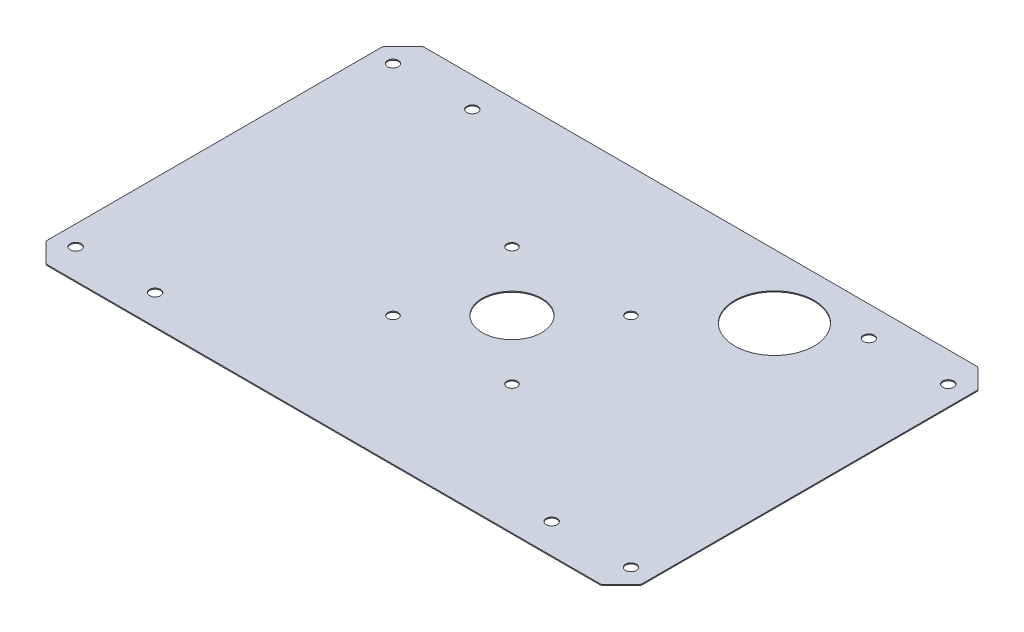
ISO-10303-21;
HEADER;
FILE_DESCRIPTION(('STEP AP214'),'2;1');
FILE_NAME('part.step','',(''),(''),'','','');
FILE_SCHEMA(('AUTOMOTIVE_DESIGN { 1 0 10303 214 1 1 1 1 }'));
ENDSEC;
DATA;
#1=APPLICATION_CONTEXT('core data for automotive mechanical design processes');
#2=APPLICATION_PROTOCOL_DEFINITION('international standard','automotive_design',2000,#1);
#3=PRODUCT_CONTEXT('',#1,'mechanical');
#4=PRODUCT('Part','Part','',(#3));
#5=PRODUCT_RELATED_PRODUCT_CATEGORY('part','',(#4));
#6=PRODUCT_DEFINITION_FORMATION('','',#4);
#7=PRODUCT_DEFINITION_CONTEXT('part definition',#1,'design');
#8=PRODUCT_DEFINITION('design','',#6,#7);
#9=PRODUCT_DEFINITION_SHAPE('','',#8);
#10=(LENGTH_UNIT() NAMED_UNIT(*) SI_UNIT(.MILLI.,.METRE.));
#11=(NAMED_UNIT(*) PLANE_ANGLE_UNIT() SI_UNIT($,.RADIAN.));
#12=(NAMED_UNIT(*) SI_UNIT($,.STERADIAN.) SOLID_ANGLE_UNIT());
#13=UNCERTAINTY_MEASURE_WITH_UNIT(LENGTH_MEASURE(1.E-05),#10,'distance_accuracy_value','');
#14=(GEOMETRIC_REPRESENTATION_CONTEXT(3) GLOBAL_UNCERTAINTY_ASSIGNED_CONTEXT((#13)) GLOBAL_UNIT_ASSIGNED_CONTEXT((#10,
#11,#12)) REPRESENTATION_CONTEXT('',''));
#15=CARTESIAN_POINT('',(0.,0.,0.));
#16=DIRECTION('',(0.,0.,1.));
#17=DIRECTION('',(1.,0.,0.));
#18=AXIS2_PLACEMENT_3D('',#15,#16,#17);
#19=CARTESIAN_POINT('',(140.,0.5,-80.));
#20=DIRECTION('',(0.,-1.,0.));
#21=DIRECTION('',(0.,0.,-1.));
#22=AXIS2_PLACEMENT_3D('',#19,#20,#21);
#23=CYLINDRICAL_SURFACE('',#22,2.75000000000001);
#24=CARTESIAN_POINT('',(140.,0.5,-80.));
#25=DIRECTION('',(0.,-1.,0.));
#26=DIRECTION('',(0.,0.,-1.));
#27=AXIS2_PLACEMENT_3D('',#24,#25,#26);
#28=CIRCLE('',#27,2.75000000000001);
#29=CARTESIAN_POINT('',(140.,0.5,-82.75));
#30=VERTEX_POINT('',#29);
#31=EDGE_CURVE('E49',#30,#30,#28,.T.);
#32=ORIENTED_EDGE('',*,*,#31,.F.);
#33=EDGE_LOOP('',(#32));
#34=FACE_BOUND('',#33,.T.);
#35=CARTESIAN_POINT('',(140.,0.,-80.));
#36=DIRECTION('',(0.,-1.,0.));
#37=DIRECTION('',(0.,0.,-1.));
#38=AXIS2_PLACEMENT_3D('',#35,#36,#37);
#39=CIRCLE('',#38,2.75000000000001);
#40=CARTESIAN_POINT('',(140.,0.,-82.75));
#41=VERTEX_POINT('',#40);
#42=EDGE_CURVE('E11',#41,#41,#39,.T.);
#43=ORIENTED_EDGE('',*,*,#42,.T.);
#44=EDGE_LOOP('',(#43));
#45=FACE_BOUND('',#44,.T.);
#46=ADVANCED_FACE('F41',(#34,#45),#23,.F.);
#47=CARTESIAN_POINT('',(-100.,0.5,-80.));
#48=DIRECTION('',(0.,-1.,0.));
#49=DIRECTION('',(0.,0.,-1.));
#50=AXIS2_PLACEMENT_3D('',#47,#48,#49);
#51=CYLINDRICAL_SURFACE('',#50,2.75000000000001);
#52=CARTESIAN_POINT('',(-100.,0.5,-80.));
#53=DIRECTION('',(0.,-1.,0.));
#54=DIRECTION('',(0.,0.,-1.));
#55=AXIS2_PLACEMENT_3D('',#52,#53,#54);
#56=CIRCLE('',#55,2.75000000000001);
#57=CARTESIAN_POINT('',(-100.,0.5,-82.75));
#58=VERTEX_POINT('',#57);
#59=EDGE_CURVE('E290',#58,#58,#56,.T.);
#60=ORIENTED_EDGE('',*,*,#59,.F.);
#61=EDGE_LOOP('',(#60));
#62=FACE_BOUND('',#61,.T.);
#63=CARTESIAN_POINT('',(-100.,0.,-80.));
#64=DIRECTION('',(0.,-1.,0.));
#65=DIRECTION('',(0.,0.,-1.));
#66=AXIS2_PLACEMENT_3D('',#63,#64,#65);
#67=CIRCLE('',#66,2.75000000000001);
#68=CARTESIAN_POINT('',(-100.,0.,-82.75));
#69=VERTEX_POINT('',#68);
#70=EDGE_CURVE('E293',#69,#69,#67,.T.);
#71=ORIENTED_EDGE('',*,*,#70,.T.);
#72=EDGE_LOOP('',(#71));
#73=FACE_BOUND('',#72,.T.);
#74=ADVANCED_FACE('F385',(#62,#73),#51,.F.);
#75=CARTESIAN_POINT('',(99.9999999999999,0.5,-80.));
#76=DIRECTION('',(0.,-1.,0.));
#77=DIRECTION('',(0.,0.,-1.));
#78=AXIS2_PLACEMENT_3D('',#75,#76,#77);
#79=CYLINDRICAL_SURFACE('',#78,2.75000000000001);
#80=CARTESIAN_POINT('',(99.9999999999999,0.5,-80.));
#81=DIRECTION('',(0.,-1.,0.));
#82=DIRECTION('',(0.,0.,-1.));
#83=AXIS2_PLACEMENT_3D('',#80,#81,#82);
#84=CIRCLE('',#83,2.75000000000001);
#85=CARTESIAN_POINT('',(99.9999999999999,0.5,-82.75));
#86=VERTEX_POINT('',#85);
#87=EDGE_CURVE('E284',#86,#86,#84,.T.);
#88=ORIENTED_EDGE('',*,*,#87,.F.);
#89=EDGE_LOOP('',(#88));
#90=FACE_BOUND('',#89,.T.);
#91=CARTESIAN_POINT('',(99.9999999999999,0.,-80.));
#92=DIRECTION('',(0.,-1.,0.));
#93=DIRECTION('',(0.,0.,-1.));
#94=AXIS2_PLACEMENT_3D('',#91,#92,#93);
#95=CIRCLE('',#94,2.75000000000001);
#96=CARTESIAN_POINT('',(99.9999999999999,0.,-82.75));
#97=VERTEX_POINT('',#96);
#98=EDGE_CURVE('E287',#97,#97,#95,.T.);
#99=ORIENTED_EDGE('',*,*,#98,.T.);
#100=EDGE_LOOP('',(#99));
#101=FACE_BOUND('',#100,.T.);
#102=ADVANCED_FACE('F390',(#90,#101),#79,.F.);
#103=CARTESIAN_POINT('',(-140.,0.5,-80.));
#104=DIRECTION('',(0.,-1.,0.));
#105=DIRECTION('',(0.,0.,-1.));
#106=AXIS2_PLACEMENT_3D('',#103,#104,#105);
#107=CYLINDRICAL_SURFACE('',#106,2.75000000000001);
#108=CARTESIAN_POINT('',(-140.,0.5,-80.));
#109=DIRECTION('',(0.,-1.,0.));
#110=DIRECTION('',(0.,0.,-1.));
#111=AXIS2_PLACEMENT_3D('',#108,#109,#110);
#112=CIRCLE('',#111,2.75000000000001);
#113=CARTESIAN_POINT('',(-140.,0.5,-82.75));
#114=VERTEX_POINT('',#113);
#115=EDGE_CURVE('E278',#114,#114,#112,.T.);
#116=ORIENTED_EDGE('',*,*,#115,.F.);
#117=EDGE_LOOP('',(#116));
#118=FACE_BOUND('',#117,.T.);
#119=CARTESIAN_POINT('',(-140.,0.,-80.));
#120=DIRECTION('',(0.,-1.,0.));
#121=DIRECTION('',(0.,0.,-1.));
#122=AXIS2_PLACEMENT_3D('',#119,#120,#121);
#123=CIRCLE('',#122,2.75000000000001);
#124=CARTESIAN_POINT('',(-140.,0.,-82.75));
#125=VERTEX_POINT('',#124);
#126=EDGE_CURVE('E281',#125,#125,#123,.T.);
#127=ORIENTED_EDGE('',*,*,#126,.T.);
#128=EDGE_LOOP('',(#127));
#129=FACE_BOUND('',#128,.T.);
#130=ADVANCED_FACE('F421',(#118,#129),#107,.F.);
#131=CARTESIAN_POINT('',(150.,0.5,95.));
#132=DIRECTION('',(-1.,0.,0.));
#133=DIRECTION('',(0.,0.,1.));
#134=AXIS2_PLACEMENT_3D('',#131,#132,#133);
#135=PLANE('',#134);
#136=DIRECTION('',(0.,0.,-1.));
#137=VECTOR('',#136,1.);
#138=CARTESIAN_POINT('',(150.,0.,95.));
#139=LINE('',#138,#137);
#140=CARTESIAN_POINT('',(150.,0.,84.1715728752538));
#141=VERTEX_POINT('',#140);
#142=CARTESIAN_POINT('',(150.,0.,-84.1715728752538));
#143=VERTEX_POINT('',#142);
#144=EDGE_CURVE('E194',#141,#143,#139,.T.);
#145=ORIENTED_EDGE('',*,*,#144,.T.);
#146=DIRECTION('',(0.,-1.,0.));
#147=VECTOR('',#146,1.);
#148=CARTESIAN_POINT('',(150.,0.5,-84.1715728752538));
#149=LINE('',#148,#147);
#150=CARTESIAN_POINT('',(150.,0.5,-84.1715728752538));
#151=VERTEX_POINT('',#150);
#152=EDGE_CURVE('E261',#143,#151,#149,.F.);
#153=ORIENTED_EDGE('',*,*,#152,.T.);
#154=DIRECTION('',(0.,0.,-1.));
#155=VECTOR('',#154,1.);
#156=CARTESIAN_POINT('',(150.,0.5,95.));
#157=LINE('',#156,#155);
#158=CARTESIAN_POINT('',(150.,0.5,84.1715728752538));
#159=VERTEX_POINT('',#158);
#160=EDGE_CURVE('E191',#159,#151,#157,.T.);
#161=ORIENTED_EDGE('',*,*,#160,.F.);
#162=DIRECTION('',(0.,1.,0.));
#163=VECTOR('',#162,1.);
#164=CARTESIAN_POINT('',(150.,0.,84.1715728752538));
#165=LINE('',#164,#163);
#166=EDGE_CURVE('E258',#159,#141,#165,.F.);
#167=ORIENTED_EDGE('',*,*,#166,.T.);
#168=EDGE_LOOP('',(#145,#153,#161,#167));
#169=FACE_BOUND('',#168,.T.);
#170=ADVANCED_FACE('F349',(#169),#135,.F.);
#171=CARTESIAN_POINT('',(-150.,0.5,-95.));
#172=DIRECTION('',(0.,0.,1.));
#173=DIRECTION('',(1.,0.,0.));
#174=AXIS2_PLACEMENT_3D('',#171,#172,#173);
#175=PLANE('',#174);
#176=DIRECTION('',(-1.,0.,0.));
#177=VECTOR('',#176,1.);
#178=CARTESIAN_POINT('',(-150.,0.,-95.));
#179=LINE('',#178,#177);
#180=CARTESIAN_POINT('',(139.171572875254,0.,-95.));
#181=VERTEX_POINT('',#180);
#182=CARTESIAN_POINT('',(-139.171572875254,0.,-95.));
#183=VERTEX_POINT('',#182);
#184=EDGE_CURVE('E188',#181,#183,#179,.T.);
#185=ORIENTED_EDGE('',*,*,#184,.T.);
#186=DIRECTION('',(0.,-1.,0.));
#187=VECTOR('',#186,1.);
#188=CARTESIAN_POINT('',(-139.171572875254,0.5,-95.));
#189=LINE('',#188,#187);
#190=CARTESIAN_POINT('',(-139.171572875254,0.5,-95.));
#191=VERTEX_POINT('',#190);
#192=EDGE_CURVE('E252',#183,#191,#189,.F.);
#193=ORIENTED_EDGE('',*,*,#192,.T.);
#194=DIRECTION('',(-1.,0.,0.));
#195=VECTOR('',#194,1.);
#196=CARTESIAN_POINT('',(-150.,0.5,-95.));
#197=LINE('',#196,#195);
#198=CARTESIAN_POINT('',(139.171572875254,0.5,-95.));
#199=VERTEX_POINT('',#198);
#200=EDGE_CURVE('E341',#199,#191,#197,.T.);
#201=ORIENTED_EDGE('',*,*,#200,.F.);
#202=DIRECTION('',(0.,1.,0.));
#203=VECTOR('',#202,1.);
#204=CARTESIAN_POINT('',(139.171572875254,0.,-95.));
#205=LINE('',#204,#203);
#206=EDGE_CURVE('E249',#199,#181,#205,.F.);
#207=ORIENTED_EDGE('',*,*,#206,.T.);
#208=EDGE_LOOP('',(#185,#193,#201,#207));
#209=FACE_BOUND('',#208,.T.);
#210=ADVANCED_FACE('F368',(#209),#175,.F.);
#211=CARTESIAN_POINT('',(-150.,0.5,95.));
#212=DIRECTION('',(1.,0.,0.));
#213=DIRECTION('',(0.,0.,-1.));
#214=AXIS2_PLACEMENT_3D('',#211,#212,#213);
#215=PLANE('',#214);
#216=DIRECTION('',(0.,0.,1.));
#217=VECTOR('',#216,1.);
#218=CARTESIAN_POINT('',(-150.,0.5,95.));
#219=LINE('',#218,#217);
#220=CARTESIAN_POINT('',(-150.,0.5,-84.1715728752538));
#221=VERTEX_POINT('',#220);
#222=CARTESIAN_POINT('',(-150.,0.5,84.1715728752538));
#223=VERTEX_POINT('',#222);
#224=EDGE_CURVE('E179',#221,#223,#219,.T.);
#225=ORIENTED_EDGE('',*,*,#224,.F.);
#226=DIRECTION('',(0.,1.,0.));
#227=VECTOR('',#226,1.);
#228=CARTESIAN_POINT('',(-150.,0.,-84.1715728752538));
#229=LINE('',#228,#227);
#230=CARTESIAN_POINT('',(-150.,0.,-84.1715728752538));
#231=VERTEX_POINT('',#230);
#232=EDGE_CURVE('E162',#221,#231,#229,.F.);
#233=ORIENTED_EDGE('',*,*,#232,.T.);
#234=DIRECTION('',(0.,0.,1.));
#235=VECTOR('',#234,1.);
#236=CARTESIAN_POINT('',(-150.,0.,95.));
#237=LINE('',#236,#235);
#238=CARTESIAN_POINT('',(-150.,0.,84.1715728752538));
#239=VERTEX_POINT('',#238);
#240=EDGE_CURVE('E176',#231,#239,#237,.T.);
#241=ORIENTED_EDGE('',*,*,#240,.T.);
#242=DIRECTION('',(0.,-1.,0.));
#243=VECTOR('',#242,1.);
#244=CARTESIAN_POINT('',(-150.,0.5,84.1715728752538));
#245=LINE('',#244,#243);
#246=EDGE_CURVE('E181',#239,#223,#245,.F.);
#247=ORIENTED_EDGE('',*,*,#246,.T.);
#248=EDGE_LOOP('',(#225,#233,#241,#247));
#249=FACE_BOUND('',#248,.T.);
#250=ADVANCED_FACE('F174',(#249),#215,.F.);
#251=CARTESIAN_POINT('',(-150.,0.5,95.));
#252=DIRECTION('',(0.,0.,-1.));
#253=DIRECTION('',(-1.,0.,0.));
#254=AXIS2_PLACEMENT_3D('',#251,#252,#253);
#255=PLANE('',#254);
#256=DIRECTION('',(1.,0.,0.));
#257=VECTOR('',#256,1.);
#258=CARTESIAN_POINT('',(-150.,0.,95.));
#259=LINE('',#258,#257);
#260=CARTESIAN_POINT('',(-139.171572875254,0.,95.));
#261=VERTEX_POINT('',#260);
#262=CARTESIAN_POINT('',(139.171572875254,0.,95.));
#263=VERTEX_POINT('',#262);
#264=EDGE_CURVE('E187',#261,#263,#259,.T.);
#265=ORIENTED_EDGE('',*,*,#264,.T.);
#266=DIRECTION('',(0.,-1.,0.));
#267=VECTOR('',#266,1.);
#268=CARTESIAN_POINT('',(139.171572875254,0.5,95.));
#269=LINE('',#268,#267);
#270=CARTESIAN_POINT('',(139.171572875254,0.5,95.));
#271=VERTEX_POINT('',#270);
#272=EDGE_CURVE('E271',#263,#271,#269,.F.);
#273=ORIENTED_EDGE('',*,*,#272,.T.);
#274=DIRECTION('',(1.,0.,0.));
#275=VECTOR('',#274,1.);
#276=CARTESIAN_POINT('',(-150.,0.5,95.));
#277=LINE('',#276,#275);
#278=CARTESIAN_POINT('',(-139.171572875254,0.5,95.));
#279=VERTEX_POINT('',#278);
#280=EDGE_CURVE('E201',#279,#271,#277,.T.);
#281=ORIENTED_EDGE('',*,*,#280,.F.);
#282=DIRECTION('',(0.,1.,0.));
#283=VECTOR('',#282,1.);
#284=CARTESIAN_POINT('',(-139.171572875254,0.,95.));
#285=LINE('',#284,#283);
#286=EDGE_CURVE('E268',#279,#261,#285,.F.);
#287=ORIENTED_EDGE('',*,*,#286,.T.);
#288=EDGE_LOOP('',(#265,#273,#281,#287));
#289=FACE_BOUND('',#288,.T.);
#290=ADVANCED_FACE('F406',(#289),#255,.F.);
#291=CARTESIAN_POINT('',(0.,0.5,0.));
#292=DIRECTION('',(0.,-1.,0.));
#293=DIRECTION('',(0.,0.,-1.));
#294=AXIS2_PLACEMENT_3D('',#291,#292,#293);
#295=PLANE('',#294);
#296=CARTESIAN_POINT('',(-30.,0.5,30.));
#297=DIRECTION('',(0.,1.,0.));
#298=DIRECTION('',(0.,0.,1.));
#299=AXIS2_PLACEMENT_3D('',#296,#297,#298);
#300=CIRCLE('',#299,2.6);
#301=CARTESIAN_POINT('',(-30.,0.5,32.6));
#302=VERTEX_POINT('',#301);
#303=EDGE_CURVE('E810',#302,#302,#300,.T.);
#304=ORIENTED_EDGE('',*,*,#303,.F.);
#305=EDGE_LOOP('',(#304));
#306=FACE_BOUND('',#305,.T.);
#307=CARTESIAN_POINT('',(30.,0.5,30.));
#308=DIRECTION('',(0.,1.,0.));
#309=DIRECTION('',(0.,0.,1.));
#310=AXIS2_PLACEMENT_3D('',#307,#308,#309);
#311=CIRCLE('',#310,2.6);
#312=CARTESIAN_POINT('',(30.,0.5,32.6));
#313=VERTEX_POINT('',#312);
#314=EDGE_CURVE('E814',#313,#313,#311,.T.);
#315=ORIENTED_EDGE('',*,*,#314,.F.);
#316=EDGE_LOOP('',(#315));
#317=FACE_BOUND('',#316,.T.);
#318=CARTESIAN_POINT('',(30.,0.5,-30.));
#319=DIRECTION('',(0.,1.,0.));
#320=DIRECTION('',(0.,0.,1.));
#321=AXIS2_PLACEMENT_3D('',#318,#319,#320);
#322=CIRCLE('',#321,2.6);
#323=CARTESIAN_POINT('',(30.,0.5,-27.4));
#324=VERTEX_POINT('',#323);
#325=EDGE_CURVE('E822',#324,#324,#322,.T.);
#326=ORIENTED_EDGE('',*,*,#325,.F.);
#327=EDGE_LOOP('',(#326));
#328=FACE_BOUND('',#327,.T.);
#329=CARTESIAN_POINT('',(-30.,0.5,-30.));
#330=DIRECTION('',(0.,1.,0.));
#331=DIRECTION('',(0.,0.,1.));
#332=AXIS2_PLACEMENT_3D('',#329,#330,#331);
#333=CIRCLE('',#332,2.6);
#334=CARTESIAN_POINT('',(-30.,0.5,-27.4));
#335=VERTEX_POINT('',#334);
#336=EDGE_CURVE('E313',#335,#335,#333,.T.);
#337=ORIENTED_EDGE('',*,*,#336,.F.);
#338=EDGE_LOOP('',(#337));
#339=FACE_BOUND('',#338,.T.);
#340=CARTESIAN_POINT('',(69.5499999999999,0.5,-62.8));
#341=DIRECTION('',(0.,1.,0.));
#342=DIRECTION('',(0.,0.,1.));
#343=AXIS2_PLACEMENT_3D('',#340,#341,#342);
#344=CIRCLE('',#343,20.);
#345=CARTESIAN_POINT('',(69.5499999999999,0.5,-42.8));
#346=VERTEX_POINT('',#345);
#347=EDGE_CURVE('E299',#346,#346,#344,.T.);
#348=ORIENTED_EDGE('',*,*,#347,.F.);
#349=EDGE_LOOP('',(#348));
#350=FACE_BOUND('',#349,.T.);
#351=CARTESIAN_POINT('',(0.,0.5,0.));
#352=DIRECTION('',(0.,1.,0.));
#353=DIRECTION('',(0.,0.,1.));
#354=AXIS2_PLACEMENT_3D('',#351,#352,#353);
#355=CIRCLE('',#354,15.);
#356=CARTESIAN_POINT('',(0.,0.5,15.));
#357=VERTEX_POINT('',#356);
#358=EDGE_CURVE('E305',#357,#357,#355,.T.);
#359=ORIENTED_EDGE('',*,*,#358,.F.);
#360=EDGE_LOOP('',(#359));
#361=FACE_BOUND('',#360,.T.);
#362=CARTESIAN_POINT('',(140.,0.5,80.));
#363=DIRECTION('',(0.,-1.,0.));
#364=DIRECTION('',(0.,0.,-1.));
#365=AXIS2_PLACEMENT_3D('',#362,#363,#364);
#366=CIRCLE('',#365,2.75000000000001);
#367=CARTESIAN_POINT('',(140.,0.5,77.25));
#368=VERTEX_POINT('',#367);
#369=EDGE_CURVE('E303',#368,#368,#366,.T.);
#370=ORIENTED_EDGE('',*,*,#369,.T.);
#371=EDGE_LOOP('',(#370));
#372=FACE_BOUND('',#371,.T.);
#373=CARTESIAN_POINT('',(99.9999999999999,0.5,80.));
#374=DIRECTION('',(0.,-1.,0.));
#375=DIRECTION('',(0.,0.,-1.));
#376=AXIS2_PLACEMENT_3D('',#373,#374,#375);
#377=CIRCLE('',#376,2.75000000000001);
#378=CARTESIAN_POINT('',(99.9999999999999,0.5,77.25));
#379=VERTEX_POINT('',#378);
#380=EDGE_CURVE('E321',#379,#379,#377,.T.);
#381=ORIENTED_EDGE('',*,*,#380,.T.);
#382=EDGE_LOOP('',(#381));
#383=FACE_BOUND('',#382,.T.);
#384=CARTESIAN_POINT('',(-140.,0.5,80.));
#385=DIRECTION('',(0.,-1.,0.));
#386=DIRECTION('',(0.,0.,-1.));
#387=AXIS2_PLACEMENT_3D('',#384,#385,#386);
#388=CIRCLE('',#387,2.75000000000001);
#389=CARTESIAN_POINT('',(-140.,0.5,77.25));
#390=VERTEX_POINT('',#389);
#391=EDGE_CURVE('E328',#390,#390,#388,.T.);
#392=ORIENTED_EDGE('',*,*,#391,.T.);
#393=EDGE_LOOP('',(#392));
#394=FACE_BOUND('',#393,.T.);
#395=CARTESIAN_POINT('',(-100.,0.5,80.));
#396=DIRECTION('',(0.,-1.,0.));
#397=DIRECTION('',(0.,0.,-1.));
#398=AXIS2_PLACEMENT_3D('',#395,#396,#397);
#399=CIRCLE('',#398,2.75000000000001);
#400=CARTESIAN_POINT('',(-100.,0.5,77.25));
#401=VERTEX_POINT('',#400);
#402=EDGE_CURVE('E327',#401,#401,#399,.T.);
#403=ORIENTED_EDGE('',*,*,#402,.T.);
#404=EDGE_LOOP('',(#403));
#405=FACE_BOUND('',#404,.T.);
#406=DIRECTION('',(0.707106781186549,0.,-0.707106781186546));
#407=VECTOR('',#406,1.);
#408=CARTESIAN_POINT('',(-150.,0.5,-85.));
#409=LINE('',#408,#407);
#410=CARTESIAN_POINT('',(-140.585786437627,0.5,-94.4142135623731));
#411=VERTEX_POINT('',#410);
#412=CARTESIAN_POINT('',(-149.414213562373,0.5,-85.5857864376269));
#413=VERTEX_POINT('',#412);
#414=EDGE_CURVE('E209',#411,#413,#409,.F.);
#415=ORIENTED_EDGE('',*,*,#414,.T.);
#416=CARTESIAN_POINT('',(-148.,0.5,-84.1715728752538));
#417=DIRECTION('',(0.,-1.,0.));
#418=DIRECTION('',(0.,0.,-1.));
#419=AXIS2_PLACEMENT_3D('',#416,#417,#418);
#420=CIRCLE('',#419,2.);
#421=EDGE_CURVE('E247',#413,#221,#420,.F.);
#422=ORIENTED_EDGE('',*,*,#421,.T.);
#423=ORIENTED_EDGE('',*,*,#224,.T.);
#424=CARTESIAN_POINT('',(-148.,0.5,84.1715728752538));
#425=DIRECTION('',(0.,-1.,0.));
#426=DIRECTION('',(0.,0.,-1.));
#427=AXIS2_PLACEMENT_3D('',#424,#425,#426);
#428=CIRCLE('',#427,2.);
#429=CARTESIAN_POINT('',(-149.414213562373,0.5,85.5857864376269));
#430=VERTEX_POINT('',#429);
#431=EDGE_CURVE('E235',#223,#430,#428,.F.);
#432=ORIENTED_EDGE('',*,*,#431,.T.);
#433=DIRECTION('',(-0.707106781186548,0.,-0.707106781186548));
#434=VECTOR('',#433,1.);
#435=CARTESIAN_POINT('',(-140.,0.5,95.));
#436=LINE('',#435,#434);
#437=CARTESIAN_POINT('',(-140.585786437627,0.5,94.4142135623731));
#438=VERTEX_POINT('',#437);
#439=EDGE_CURVE('E217',#430,#438,#436,.F.);
#440=ORIENTED_EDGE('',*,*,#439,.T.);
#441=CARTESIAN_POINT('',(-139.171572875254,0.5,93.));
#442=DIRECTION('',(0.,-1.,0.));
#443=DIRECTION('',(0.,0.,-1.));
#444=AXIS2_PLACEMENT_3D('',#441,#442,#443);
#445=CIRCLE('',#444,2.);
#446=EDGE_CURVE('E237',#438,#279,#445,.F.);
#447=ORIENTED_EDGE('',*,*,#446,.T.);
#448=ORIENTED_EDGE('',*,*,#280,.T.);
#449=CARTESIAN_POINT('',(139.171572875254,0.5,93.));
#450=DIRECTION('',(0.,-1.,0.));
#451=DIRECTION('',(0.,0.,-1.));
#452=AXIS2_PLACEMENT_3D('',#449,#450,#451);
#453=CIRCLE('',#452,2.);
#454=CARTESIAN_POINT('',(140.585786437627,0.5,94.4142135623731));
#455=VERTEX_POINT('',#454);
#456=EDGE_CURVE('E239',#271,#455,#453,.F.);
#457=ORIENTED_EDGE('',*,*,#456,.T.);
#458=DIRECTION('',(-0.707106781186549,0.,0.707106781186546));
#459=VECTOR('',#458,1.);
#460=CARTESIAN_POINT('',(150.,0.5,85.));
#461=LINE('',#460,#459);
#462=CARTESIAN_POINT('',(149.414213562373,0.5,85.5857864376269));
#463=VERTEX_POINT('',#462);
#464=EDGE_CURVE('E214',#455,#463,#461,.F.);
#465=ORIENTED_EDGE('',*,*,#464,.T.);
#466=CARTESIAN_POINT('',(148.,0.5,84.1715728752538));
#467=DIRECTION('',(0.,-1.,0.));
#468=DIRECTION('',(0.,0.,-1.));
#469=AXIS2_PLACEMENT_3D('',#466,#467,#468);
#470=CIRCLE('',#469,2.);
#471=EDGE_CURVE('E241',#463,#159,#470,.F.);
#472=ORIENTED_EDGE('',*,*,#471,.T.);
#473=ORIENTED_EDGE('',*,*,#160,.T.);
#474=CARTESIAN_POINT('',(148.,0.5,-84.1715728752538));
#475=DIRECTION('',(0.,-1.,0.));
#476=DIRECTION('',(0.,0.,-1.));
#477=AXIS2_PLACEMENT_3D('',#474,#475,#476);
#478=CIRCLE('',#477,2.);
#479=CARTESIAN_POINT('',(149.414213562373,0.5,-85.5857864376269));
#480=VERTEX_POINT('',#479);
#481=EDGE_CURVE('E243',#151,#480,#478,.F.);
#482=ORIENTED_EDGE('',*,*,#481,.T.);
#483=DIRECTION('',(0.707106781186548,0.,0.707106781186548));
#484=VECTOR('',#483,1.);
#485=CARTESIAN_POINT('',(140.,0.5,-95.));
#486=LINE('',#485,#484);
#487=CARTESIAN_POINT('',(140.585786437627,0.5,-94.4142135623731));
#488=VERTEX_POINT('',#487);
#489=EDGE_CURVE('E212',#480,#488,#486,.F.);
#490=ORIENTED_EDGE('',*,*,#489,.T.);
#491=CARTESIAN_POINT('',(139.171572875254,0.5,-93.));
#492=DIRECTION('',(0.,-1.,0.));
#493=DIRECTION('',(0.,0.,-1.));
#494=AXIS2_PLACEMENT_3D('',#491,#492,#493);
#495=CIRCLE('',#494,2.);
#496=EDGE_CURVE('E65',#488,#199,#495,.F.);
#497=ORIENTED_EDGE('',*,*,#496,.T.);
#498=ORIENTED_EDGE('',*,*,#200,.T.);
#499=CARTESIAN_POINT('',(-139.171572875254,0.5,-93.));
#500=DIRECTION('',(0.,-1.,0.));
#501=DIRECTION('',(0.,0.,-1.));
#502=AXIS2_PLACEMENT_3D('',#499,#500,#501);
#503=CIRCLE('',#502,2.);
#504=EDGE_CURVE('E57',#191,#411,#503,.F.);
#505=ORIENTED_EDGE('',*,*,#504,.T.);
#506=EDGE_LOOP('',(#415,#422,#423,#432,#440,#447,#448,#457,#465,#472,#473,#482,#490,#497,#498,#505));
#507=FACE_BOUND('',#506,.T.);
#508=ORIENTED_EDGE('',*,*,#115,.T.);
#509=EDGE_LOOP('',(#508));
#510=FACE_BOUND('',#509,.T.);
#511=ORIENTED_EDGE('',*,*,#87,.T.);
#512=EDGE_LOOP('',(#511));
#513=FACE_BOUND('',#512,.T.);
#514=ORIENTED_EDGE('',*,*,#59,.T.);
#515=EDGE_LOOP('',(#514));
#516=FACE_BOUND('',#515,.T.);
#517=ORIENTED_EDGE('',*,*,#31,.T.);
#518=EDGE_LOOP('',(#517));
#519=FACE_BOUND('',#518,.T.);
#520=ADVANCED_FACE('F357',(#306,#317,#328,#339,#350,#361,#372,#383,#394,#405,#507,#510,#513,
#516,#519),#295,.F.);
#521=CARTESIAN_POINT('',(0.,0.,0.));
#522=DIRECTION('',(0.,-1.,0.));
#523=DIRECTION('',(0.,0.,-1.));
#524=AXIS2_PLACEMENT_3D('',#521,#522,#523);
#525=PLANE('',#524);
#526=CARTESIAN_POINT('',(-30.,0.,30.));
#527=DIRECTION('',(0.,1.,0.));
#528=DIRECTION('',(0.,0.,1.));
#529=AXIS2_PLACEMENT_3D('',#526,#527,#528);
#530=CIRCLE('',#529,2.6);
#531=CARTESIAN_POINT('',(-30.,0.,32.6));
#532=VERTEX_POINT('',#531);
#533=EDGE_CURVE('E807',#532,#532,#530,.T.);
#534=ORIENTED_EDGE('',*,*,#533,.T.);
#535=EDGE_LOOP('',(#534));
#536=FACE_BOUND('',#535,.T.);
#537=CARTESIAN_POINT('',(30.,0.,30.));
#538=DIRECTION('',(0.,1.,0.));
#539=DIRECTION('',(0.,0.,1.));
#540=AXIS2_PLACEMENT_3D('',#537,#538,#539);
#541=CIRCLE('',#540,2.6);
#542=CARTESIAN_POINT('',(30.,0.,32.6));
#543=VERTEX_POINT('',#542);
#544=EDGE_CURVE('E811',#543,#543,#541,.T.);
#545=ORIENTED_EDGE('',*,*,#544,.T.);
#546=EDGE_LOOP('',(#545));
#547=FACE_BOUND('',#546,.T.);
#548=CARTESIAN_POINT('',(30.,0.,-30.));
#549=DIRECTION('',(0.,1.,0.));
#550=DIRECTION('',(0.,0.,1.));
#551=AXIS2_PLACEMENT_3D('',#548,#549,#550);
#552=CIRCLE('',#551,2.6);
#553=CARTESIAN_POINT('',(30.,0.,-27.4));
#554=VERTEX_POINT('',#553);
#555=EDGE_CURVE('E826',#554,#554,#552,.T.);
#556=ORIENTED_EDGE('',*,*,#555,.T.);
#557=EDGE_LOOP('',(#556));
#558=FACE_BOUND('',#557,.T.);
#559=CARTESIAN_POINT('',(-30.,0.,-30.));
#560=DIRECTION('',(0.,1.,0.));
#561=DIRECTION('',(0.,0.,1.));
#562=AXIS2_PLACEMENT_3D('',#559,#560,#561);
#563=CIRCLE('',#562,2.6);
#564=CARTESIAN_POINT('',(-30.,0.,-27.4));
#565=VERTEX_POINT('',#564);
#566=EDGE_CURVE('E310',#565,#565,#563,.T.);
#567=ORIENTED_EDGE('',*,*,#566,.T.);
#568=EDGE_LOOP('',(#567));
#569=FACE_BOUND('',#568,.T.);
#570=CARTESIAN_POINT('',(69.5499999999999,0.,-62.8));
#571=DIRECTION('',(0.,-1.,0.));
#572=DIRECTION('',(0.,0.,-1.));
#573=AXIS2_PLACEMENT_3D('',#570,#571,#572);
#574=CIRCLE('',#573,20.);
#575=CARTESIAN_POINT('',(69.5499999999999,0.,-82.8));
#576=VERTEX_POINT('',#575);
#577=EDGE_CURVE('E44',#576,#576,#574,.T.);
#578=ORIENTED_EDGE('',*,*,#577,.F.);
#579=EDGE_LOOP('',(#578));
#580=FACE_BOUND('',#579,.T.);
#581=CARTESIAN_POINT('',(0.,0.,0.));
#582=DIRECTION('',(0.,-1.,0.));
#583=DIRECTION('',(0.,0.,-1.));
#584=AXIS2_PLACEMENT_3D('',#581,#582,#583);
#585=CIRCLE('',#584,15.);
#586=CARTESIAN_POINT('',(0.,0.,-15.));
#587=VERTEX_POINT('',#586);
#588=EDGE_CURVE('E297',#587,#587,#585,.T.);
#589=ORIENTED_EDGE('',*,*,#588,.F.);
#590=EDGE_LOOP('',(#589));
#591=FACE_BOUND('',#590,.T.);
#592=CARTESIAN_POINT('',(140.,0.,80.));
#593=DIRECTION('',(0.,-1.,0.));
#594=DIRECTION('',(0.,0.,-1.));
#595=AXIS2_PLACEMENT_3D('',#592,#593,#594);
#596=CIRCLE('',#595,2.75000000000001);
#597=CARTESIAN_POINT('',(140.,0.,77.25));
#598=VERTEX_POINT('',#597);
#599=EDGE_CURVE('E318',#598,#598,#596,.T.);
#600=ORIENTED_EDGE('',*,*,#599,.F.);
#601=EDGE_LOOP('',(#600));
#602=FACE_BOUND('',#601,.T.);
#603=CARTESIAN_POINT('',(99.9999999999999,0.,80.));
#604=DIRECTION('',(0.,-1.,0.));
#605=DIRECTION('',(0.,0.,-1.));
#606=AXIS2_PLACEMENT_3D('',#603,#604,#605);
#607=CIRCLE('',#606,2.75000000000001);
#608=CARTESIAN_POINT('',(99.9999999999999,0.,77.25));
#609=VERTEX_POINT('',#608);
#610=EDGE_CURVE('E324',#609,#609,#607,.T.);
#611=ORIENTED_EDGE('',*,*,#610,.F.);
#612=EDGE_LOOP('',(#611));
#613=FACE_BOUND('',#612,.T.);
#614=CARTESIAN_POINT('',(-140.,0.,80.));
#615=DIRECTION('',(0.,-1.,0.));
#616=DIRECTION('',(0.,0.,-1.));
#617=AXIS2_PLACEMENT_3D('',#614,#615,#616);
#618=CIRCLE('',#617,2.75000000000001);
#619=CARTESIAN_POINT('',(-140.,0.,77.25));
#620=VERTEX_POINT('',#619);
#621=EDGE_CURVE('E331',#620,#620,#618,.T.);
#622=ORIENTED_EDGE('',*,*,#621,.F.);
#623=EDGE_LOOP('',(#622));
#624=FACE_BOUND('',#623,.T.);
#625=CARTESIAN_POINT('',(-100.,0.,80.));
#626=DIRECTION('',(0.,-1.,0.));
#627=DIRECTION('',(0.,0.,-1.));
#628=AXIS2_PLACEMENT_3D('',#625,#626,#627);
#629=CIRCLE('',#628,2.75000000000001);
#630=CARTESIAN_POINT('',(-100.,0.,77.25));
#631=VERTEX_POINT('',#630);
#632=EDGE_CURVE('E334',#631,#631,#629,.T.);
#633=ORIENTED_EDGE('',*,*,#632,.F.);
#634=EDGE_LOOP('',(#633));
#635=FACE_BOUND('',#634,.T.);
#636=ORIENTED_EDGE('',*,*,#240,.F.);
#637=CARTESIAN_POINT('',(-148.,0.,-84.1715728752538));
#638=DIRECTION('',(0.,-1.,0.));
#639=DIRECTION('',(0.,0.,-1.));
#640=AXIS2_PLACEMENT_3D('',#637,#638,#639);
#641=CIRCLE('',#640,2.);
#642=CARTESIAN_POINT('',(-149.414213562373,0.,-85.585786437627));
#643=VERTEX_POINT('',#642);
#644=EDGE_CURVE('E158',#231,#643,#641,.T.);
#645=ORIENTED_EDGE('',*,*,#644,.T.);
#646=DIRECTION('',(-0.707106781186549,0.,0.707106781186546));
#647=VECTOR('',#646,1.);
#648=CARTESIAN_POINT('',(-117.5,0.,-117.5));
#649=LINE('',#648,#647);
#650=CARTESIAN_POINT('',(-140.585786437627,0.,-94.4142135623731));
#651=VERTEX_POINT('',#650);
#652=EDGE_CURVE('E198',#643,#651,#649,.F.);
#653=ORIENTED_EDGE('',*,*,#652,.T.);
#654=CARTESIAN_POINT('',(-139.171572875254,0.,-93.));
#655=DIRECTION('',(0.,-1.,0.));
#656=DIRECTION('',(0.,0.,-1.));
#657=AXIS2_PLACEMENT_3D('',#654,#655,#656);
#658=CIRCLE('',#657,2.);
#659=EDGE_CURVE('E169',#651,#183,#658,.T.);
#660=ORIENTED_EDGE('',*,*,#659,.T.);
#661=ORIENTED_EDGE('',*,*,#184,.F.);
#662=CARTESIAN_POINT('',(139.171572875254,0.,-93.));
#663=DIRECTION('',(0.,-1.,0.));
#664=DIRECTION('',(0.,0.,-1.));
#665=AXIS2_PLACEMENT_3D('',#662,#663,#664);
#666=CIRCLE('',#665,2.);
#667=CARTESIAN_POINT('',(140.585786437627,0.,-94.4142135623731));
#668=VERTEX_POINT('',#667);
#669=EDGE_CURVE('E230',#181,#668,#666,.T.);
#670=ORIENTED_EDGE('',*,*,#669,.T.);
#671=DIRECTION('',(-0.707106781186548,0.,-0.707106781186548));
#672=VECTOR('',#671,1.);
#673=CARTESIAN_POINT('',(117.5,0.,-117.5));
#674=LINE('',#673,#672);
#675=CARTESIAN_POINT('',(149.414213562373,0.,-85.5857864376269));
#676=VERTEX_POINT('',#675);
#677=EDGE_CURVE('E200',#668,#676,#674,.F.);
#678=ORIENTED_EDGE('',*,*,#677,.T.);
#679=CARTESIAN_POINT('',(148.,0.,-84.1715728752538));
#680=DIRECTION('',(0.,-1.,0.));
#681=DIRECTION('',(0.,0.,-1.));
#682=AXIS2_PLACEMENT_3D('',#679,#680,#681);
#683=CIRCLE('',#682,2.);
#684=EDGE_CURVE('E228',#676,#143,#683,.T.);
#685=ORIENTED_EDGE('',*,*,#684,.T.);
#686=ORIENTED_EDGE('',*,*,#144,.F.);
#687=CARTESIAN_POINT('',(148.,0.,84.1715728752538));
#688=DIRECTION('',(0.,-1.,0.));
#689=DIRECTION('',(0.,0.,-1.));
#690=AXIS2_PLACEMENT_3D('',#687,#688,#689);
#691=CIRCLE('',#690,2.);
#692=CARTESIAN_POINT('',(149.414213562373,0.,85.5857864376269));
#693=VERTEX_POINT('',#692);
#694=EDGE_CURVE('E226',#141,#693,#691,.T.);
#695=ORIENTED_EDGE('',*,*,#694,.T.);
#696=DIRECTION('',(0.707106781186549,0.,-0.707106781186546));
#697=VECTOR('',#696,1.);
#698=CARTESIAN_POINT('',(117.5,0.,117.5));
#699=LINE('',#698,#697);
#700=CARTESIAN_POINT('',(140.585786437627,0.,94.4142135623731));
#701=VERTEX_POINT('',#700);
#702=EDGE_CURVE('E204',#693,#701,#699,.F.);
#703=ORIENTED_EDGE('',*,*,#702,.T.);
#704=CARTESIAN_POINT('',(139.171572875254,0.,93.));
#705=DIRECTION('',(0.,-1.,0.));
#706=DIRECTION('',(0.,0.,-1.));
#707=AXIS2_PLACEMENT_3D('',#704,#705,#706);
#708=CIRCLE('',#707,2.);
#709=EDGE_CURVE('E224',#701,#263,#708,.T.);
#710=ORIENTED_EDGE('',*,*,#709,.T.);
#711=ORIENTED_EDGE('',*,*,#264,.F.);
#712=CARTESIAN_POINT('',(-139.171572875254,0.,93.));
#713=DIRECTION('',(0.,-1.,0.));
#714=DIRECTION('',(0.,0.,-1.));
#715=AXIS2_PLACEMENT_3D('',#712,#713,#714);
#716=CIRCLE('',#715,2.);
#717=CARTESIAN_POINT('',(-140.585786437627,0.,94.4142135623731));
#718=VERTEX_POINT('',#717);
#719=EDGE_CURVE('E222',#261,#718,#716,.T.);
#720=ORIENTED_EDGE('',*,*,#719,.T.);
#721=DIRECTION('',(0.707106781186548,0.,0.707106781186548));
#722=VECTOR('',#721,1.);
#723=CARTESIAN_POINT('',(-117.5,0.,117.5));
#724=LINE('',#723,#722);
#725=CARTESIAN_POINT('',(-149.414213562373,0.,85.5857864376269));
#726=VERTEX_POINT('',#725);
#727=EDGE_CURVE('E207',#718,#726,#724,.F.);
#728=ORIENTED_EDGE('',*,*,#727,.T.);
#729=CARTESIAN_POINT('',(-148.,0.,84.1715728752538));
#730=DIRECTION('',(0.,-1.,0.));
#731=DIRECTION('',(0.,0.,-1.));
#732=AXIS2_PLACEMENT_3D('',#729,#730,#731);
#733=CIRCLE('',#732,2.);
#734=EDGE_CURVE('E180',#726,#239,#733,.T.);
#735=ORIENTED_EDGE('',*,*,#734,.T.);
#736=EDGE_LOOP('',(#636,#645,#653,#660,#661,#670,#678,#685,#686,#695,#703,#710,#711,#720,#728,#735));
#737=FACE_BOUND('',#736,.T.);
#738=ORIENTED_EDGE('',*,*,#126,.F.);
#739=EDGE_LOOP('',(#738));
#740=FACE_BOUND('',#739,.T.);
#741=ORIENTED_EDGE('',*,*,#98,.F.);
#742=EDGE_LOOP('',(#741));
#743=FACE_BOUND('',#742,.T.);
#744=ORIENTED_EDGE('',*,*,#70,.F.);
#745=EDGE_LOOP('',(#744));
#746=FACE_BOUND('',#745,.T.);
#747=ORIENTED_EDGE('',*,*,#42,.F.);
#748=EDGE_LOOP('',(#747));
#749=FACE_BOUND('',#748,.T.);
#750=ADVANCED_FACE('F183',(#536,#547,#558,#569,#580,#591,#602,#613,#624,#635,#737,#740,#743,
#746,#749),#525,.T.);
#751=CARTESIAN_POINT('',(-140.,0.5,95.));
#752=DIRECTION('',(0.707106781186547,0.,-0.707106781186547));
#753=DIRECTION('',(0.,-1.,0.));
#754=AXIS2_PLACEMENT_3D('',#751,#752,#753);
#755=PLANE('',#754);
#756=ORIENTED_EDGE('',*,*,#727,.F.);
#757=DIRECTION('',(0.,-1.,0.));
#758=VECTOR('',#757,1.);
#759=CARTESIAN_POINT('',(-140.585786437627,0.5,94.4142135623731));
#760=LINE('',#759,#758);
#761=EDGE_CURVE('E276',#718,#438,#760,.F.);
#762=ORIENTED_EDGE('',*,*,#761,.T.);
#763=ORIENTED_EDGE('',*,*,#439,.F.);
#764=DIRECTION('',(0.,1.,0.));
#765=VECTOR('',#764,1.);
#766=CARTESIAN_POINT('',(-149.414213562373,0.,85.5857864376269));
#767=LINE('',#766,#765);
#768=EDGE_CURVE('E274',#430,#726,#767,.F.);
#769=ORIENTED_EDGE('',*,*,#768,.T.);
#770=EDGE_LOOP('',(#756,#762,#763,#769));
#771=FACE_BOUND('',#770,.T.);
#772=ADVANCED_FACE('F397',(#771),#755,.F.);
#773=CARTESIAN_POINT('',(150.,0.5,85.));
#774=DIRECTION('',(-0.707106781186545,0.,-0.707106781186549));
#775=DIRECTION('',(0.,-1.,0.));
#776=AXIS2_PLACEMENT_3D('',#773,#774,#775);
#777=PLANE('',#776);
#778=ORIENTED_EDGE('',*,*,#702,.F.);
#779=DIRECTION('',(0.,-1.,0.));
#780=VECTOR('',#779,1.);
#781=CARTESIAN_POINT('',(149.414213562373,0.5,85.5857864376269));
#782=LINE('',#781,#780);
#783=EDGE_CURVE('E266',#693,#463,#782,.F.);
#784=ORIENTED_EDGE('',*,*,#783,.T.);
#785=ORIENTED_EDGE('',*,*,#464,.F.);
#786=DIRECTION('',(0.,1.,0.));
#787=VECTOR('',#786,1.);
#788=CARTESIAN_POINT('',(140.585786437627,0.,94.4142135623731));
#789=LINE('',#788,#787);
#790=EDGE_CURVE('E264',#455,#701,#789,.F.);
#791=ORIENTED_EDGE('',*,*,#790,.T.);
#792=EDGE_LOOP('',(#778,#784,#785,#791));
#793=FACE_BOUND('',#792,.T.);
#794=ADVANCED_FACE('F381',(#793),#777,.F.);
#795=CARTESIAN_POINT('',(140.,0.5,-95.));
#796=DIRECTION('',(-0.707106781186547,0.,0.707106781186547));
#797=DIRECTION('',(0.,-1.,0.));
#798=AXIS2_PLACEMENT_3D('',#795,#796,#797);
#799=PLANE('',#798);
#800=ORIENTED_EDGE('',*,*,#677,.F.);
#801=DIRECTION('',(0.,-1.,0.));
#802=VECTOR('',#801,1.);
#803=CARTESIAN_POINT('',(140.585786437627,0.5,-94.4142135623731));
#804=LINE('',#803,#802);
#805=EDGE_CURVE('E256',#668,#488,#804,.F.);
#806=ORIENTED_EDGE('',*,*,#805,.T.);
#807=ORIENTED_EDGE('',*,*,#489,.F.);
#808=DIRECTION('',(0.,1.,0.));
#809=VECTOR('',#808,1.);
#810=CARTESIAN_POINT('',(149.414213562373,0.,-85.5857864376269));
#811=LINE('',#810,#809);
#812=EDGE_CURVE('E254',#480,#676,#811,.F.);
#813=ORIENTED_EDGE('',*,*,#812,.T.);
#814=EDGE_LOOP('',(#800,#806,#807,#813));
#815=FACE_BOUND('',#814,.T.);
#816=ADVANCED_FACE('F361',(#815),#799,.F.);
#817=CARTESIAN_POINT('',(-150.,0.5,-85.));
#818=DIRECTION('',(0.707106781186546,0.,0.707106781186549));
#819=DIRECTION('',(0.,-1.,0.));
#820=AXIS2_PLACEMENT_3D('',#817,#818,#819);
#821=PLANE('',#820);
#822=ORIENTED_EDGE('',*,*,#652,.F.);
#823=DIRECTION('',(0.,-1.,0.));
#824=VECTOR('',#823,1.);
#825=CARTESIAN_POINT('',(-149.414213562373,0.5,-85.5857864376269));
#826=LINE('',#825,#824);
#827=EDGE_CURVE('E163',#643,#413,#826,.F.);
#828=ORIENTED_EDGE('',*,*,#827,.T.);
#829=ORIENTED_EDGE('',*,*,#414,.F.);
#830=DIRECTION('',(0.,1.,0.));
#831=VECTOR('',#830,1.);
#832=CARTESIAN_POINT('',(-140.585786437627,0.,-94.4142135623731));
#833=LINE('',#832,#831);
#834=EDGE_CURVE('E168',#411,#651,#833,.F.);
#835=ORIENTED_EDGE('',*,*,#834,.T.);
#836=EDGE_LOOP('',(#822,#828,#829,#835));
#837=FACE_BOUND('',#836,.T.);
#838=ADVANCED_FACE('F373',(#837),#821,.F.);
#839=CARTESIAN_POINT('',(-148.,0.5,-84.1715728752538));
#840=DIRECTION('',(0.,-1.,0.));
#841=DIRECTION('',(0.,0.,-1.));
#842=AXIS2_PLACEMENT_3D('',#839,#840,#841);
#843=CYLINDRICAL_SURFACE('',#842,2.);
#844=ORIENTED_EDGE('',*,*,#421,.F.);
#845=ORIENTED_EDGE('',*,*,#827,.F.);
#846=ORIENTED_EDGE('',*,*,#644,.F.);
#847=ORIENTED_EDGE('',*,*,#232,.F.);
#848=EDGE_LOOP('',(#844,#845,#846,#847));
#849=FACE_BOUND('',#848,.T.);
#850=ADVANCED_FACE('F161',(#849),#843,.T.);
#851=CARTESIAN_POINT('',(-139.171572875254,0.5,-93.));
#852=DIRECTION('',(0.,1.,0.));
#853=DIRECTION('',(0.,0.,1.));
#854=AXIS2_PLACEMENT_3D('',#851,#852,#853);
#855=CYLINDRICAL_SURFACE('',#854,2.);
#856=ORIENTED_EDGE('',*,*,#659,.F.);
#857=ORIENTED_EDGE('',*,*,#834,.F.);
#858=ORIENTED_EDGE('',*,*,#504,.F.);
#859=ORIENTED_EDGE('',*,*,#192,.F.);
#860=EDGE_LOOP('',(#856,#857,#858,#859));
#861=FACE_BOUND('',#860,.T.);
#862=ADVANCED_FACE('F370',(#861),#855,.T.);
#863=CARTESIAN_POINT('',(139.171572875254,0.5,-93.));
#864=DIRECTION('',(0.,-1.,0.));
#865=DIRECTION('',(0.,0.,-1.));
#866=AXIS2_PLACEMENT_3D('',#863,#864,#865);
#867=CYLINDRICAL_SURFACE('',#866,2.);
#868=ORIENTED_EDGE('',*,*,#496,.F.);
#869=ORIENTED_EDGE('',*,*,#805,.F.);
#870=ORIENTED_EDGE('',*,*,#669,.F.);
#871=ORIENTED_EDGE('',*,*,#206,.F.);
#872=EDGE_LOOP('',(#868,#869,#870,#871));
#873=FACE_BOUND('',#872,.T.);
#874=ADVANCED_FACE('F364',(#873),#867,.T.);
#875=CARTESIAN_POINT('',(148.,0.5,-84.1715728752538));
#876=DIRECTION('',(0.,1.,0.));
#877=DIRECTION('',(0.,0.,1.));
#878=AXIS2_PLACEMENT_3D('',#875,#876,#877);
#879=CYLINDRICAL_SURFACE('',#878,2.);
#880=ORIENTED_EDGE('',*,*,#684,.F.);
#881=ORIENTED_EDGE('',*,*,#812,.F.);
#882=ORIENTED_EDGE('',*,*,#481,.F.);
#883=ORIENTED_EDGE('',*,*,#152,.F.);
#884=EDGE_LOOP('',(#880,#881,#882,#883));
#885=FACE_BOUND('',#884,.T.);
#886=ADVANCED_FACE('F354',(#885),#879,.T.);
#887=CARTESIAN_POINT('',(148.,0.5,84.1715728752538));
#888=DIRECTION('',(0.,-1.,0.));
#889=DIRECTION('',(0.,0.,-1.));
#890=AXIS2_PLACEMENT_3D('',#887,#888,#889);
#891=CYLINDRICAL_SURFACE('',#890,2.);
#892=ORIENTED_EDGE('',*,*,#471,.F.);
#893=ORIENTED_EDGE('',*,*,#783,.F.);
#894=ORIENTED_EDGE('',*,*,#694,.F.);
#895=ORIENTED_EDGE('',*,*,#166,.F.);
#896=EDGE_LOOP('',(#892,#893,#894,#895));
#897=FACE_BOUND('',#896,.T.);
#898=ADVANCED_FACE('F445',(#897),#891,.T.);
#899=CARTESIAN_POINT('',(139.171572875254,0.5,93.));
#900=DIRECTION('',(0.,1.,0.));
#901=DIRECTION('',(0.,0.,1.));
#902=AXIS2_PLACEMENT_3D('',#899,#900,#901);
#903=CYLINDRICAL_SURFACE('',#902,2.);
#904=ORIENTED_EDGE('',*,*,#709,.F.);
#905=ORIENTED_EDGE('',*,*,#790,.F.);
#906=ORIENTED_EDGE('',*,*,#456,.F.);
#907=ORIENTED_EDGE('',*,*,#272,.F.);
#908=EDGE_LOOP('',(#904,#905,#906,#907));
#909=FACE_BOUND('',#908,.T.);
#910=ADVANCED_FACE('F447',(#909),#903,.T.);
#911=CARTESIAN_POINT('',(-139.171572875254,0.5,93.));
#912=DIRECTION('',(0.,-1.,0.));
#913=DIRECTION('',(0.,0.,-1.));
#914=AXIS2_PLACEMENT_3D('',#911,#912,#913);
#915=CYLINDRICAL_SURFACE('',#914,2.);
#916=ORIENTED_EDGE('',*,*,#446,.F.);
#917=ORIENTED_EDGE('',*,*,#761,.F.);
#918=ORIENTED_EDGE('',*,*,#719,.F.);
#919=ORIENTED_EDGE('',*,*,#286,.F.);
#920=EDGE_LOOP('',(#916,#917,#918,#919));
#921=FACE_BOUND('',#920,.T.);
#922=ADVANCED_FACE('F454',(#921),#915,.T.);
#923=CARTESIAN_POINT('',(-148.,0.5,84.1715728752538));
#924=DIRECTION('',(0.,1.,0.));
#925=DIRECTION('',(0.,0.,1.));
#926=AXIS2_PLACEMENT_3D('',#923,#924,#925);
#927=CYLINDRICAL_SURFACE('',#926,2.);
#928=ORIENTED_EDGE('',*,*,#734,.F.);
#929=ORIENTED_EDGE('',*,*,#768,.F.);
#930=ORIENTED_EDGE('',*,*,#431,.F.);
#931=ORIENTED_EDGE('',*,*,#246,.F.);
#932=EDGE_LOOP('',(#928,#929,#930,#931));
#933=FACE_BOUND('',#932,.T.);
#934=ADVANCED_FACE('F460',(#933),#927,.T.);
#935=CARTESIAN_POINT('',(-100.,0.5,80.));
#936=DIRECTION('',(0.,-1.,0.));
#937=DIRECTION('',(0.,0.,-1.));
#938=AXIS2_PLACEMENT_3D('',#935,#936,#937);
#939=CYLINDRICAL_SURFACE('',#938,2.75000000000001);
#940=ORIENTED_EDGE('',*,*,#402,.F.);
#941=EDGE_LOOP('',(#940));
#942=FACE_BOUND('',#941,.T.);
#943=ORIENTED_EDGE('',*,*,#632,.T.);
#944=EDGE_LOOP('',(#943));
#945=FACE_BOUND('',#944,.T.);
#946=ADVANCED_FACE('F462',(#942,#945),#939,.F.);
#947=CARTESIAN_POINT('',(-140.,0.5,80.));
#948=DIRECTION('',(0.,-1.,0.));
#949=DIRECTION('',(0.,0.,-1.));
#950=AXIS2_PLACEMENT_3D('',#947,#948,#949);
#951=CYLINDRICAL_SURFACE('',#950,2.75000000000001);
#952=ORIENTED_EDGE('',*,*,#391,.F.);
#953=EDGE_LOOP('',(#952));
#954=FACE_BOUND('',#953,.T.);
#955=ORIENTED_EDGE('',*,*,#621,.T.);
#956=EDGE_LOOP('',(#955));
#957=FACE_BOUND('',#956,.T.);
#958=ADVANCED_FACE('F468',(#954,#957),#951,.F.);
#959=CARTESIAN_POINT('',(99.9999999999999,0.5,80.));
#960=DIRECTION('',(0.,-1.,0.));
#961=DIRECTION('',(0.,0.,-1.));
#962=AXIS2_PLACEMENT_3D('',#959,#960,#961);
#963=CYLINDRICAL_SURFACE('',#962,2.75000000000001);
#964=ORIENTED_EDGE('',*,*,#380,.F.);
#965=EDGE_LOOP('',(#964));
#966=FACE_BOUND('',#965,.T.);
#967=ORIENTED_EDGE('',*,*,#610,.T.);
#968=EDGE_LOOP('',(#967));
#969=FACE_BOUND('',#968,.T.);
#970=ADVANCED_FACE('F612',(#966,#969),#963,.F.);
#971=CARTESIAN_POINT('',(140.,0.5,80.));
#972=DIRECTION('',(0.,-1.,0.));
#973=DIRECTION('',(0.,0.,-1.));
#974=AXIS2_PLACEMENT_3D('',#971,#972,#973);
#975=CYLINDRICAL_SURFACE('',#974,2.75000000000001);
#976=ORIENTED_EDGE('',*,*,#369,.F.);
#977=EDGE_LOOP('',(#976));
#978=FACE_BOUND('',#977,.T.);
#979=ORIENTED_EDGE('',*,*,#599,.T.);
#980=EDGE_LOOP('',(#979));
#981=FACE_BOUND('',#980,.T.);
#982=ADVANCED_FACE('F593',(#978,#981),#975,.F.);
#983=CARTESIAN_POINT('',(0.,-9.5,0.));
#984=DIRECTION('',(0.,1.,0.));
#985=DIRECTION('',(0.,0.,1.));
#986=AXIS2_PLACEMENT_3D('',#983,#984,#985);
#987=CYLINDRICAL_SURFACE('',#986,15.);
#988=ORIENTED_EDGE('',*,*,#588,.T.);
#989=EDGE_LOOP('',(#988));
#990=FACE_BOUND('',#989,.T.);
#991=ORIENTED_EDGE('',*,*,#358,.T.);
#992=EDGE_LOOP('',(#991));
#993=FACE_BOUND('',#992,.T.);
#994=ADVANCED_FACE('F584',(#990,#993),#987,.F.);
#995=CARTESIAN_POINT('',(69.5499999999999,-9.5,-62.8));
#996=DIRECTION('',(0.,1.,0.));
#997=DIRECTION('',(0.,0.,1.));
#998=AXIS2_PLACEMENT_3D('',#995,#996,#997);
#999=CYLINDRICAL_SURFACE('',#998,20.);
#1000=ORIENTED_EDGE('',*,*,#577,.T.);
#1001=EDGE_LOOP('',(#1000));
#1002=FACE_BOUND('',#1001,.T.);
#1003=ORIENTED_EDGE('',*,*,#347,.T.);
#1004=EDGE_LOOP('',(#1003));
#1005=FACE_BOUND('',#1004,.T.);
#1006=ADVANCED_FACE('F526',(#1002,#1005),#999,.F.);
#1007=CARTESIAN_POINT('',(-30.,0.,-30.));
#1008=DIRECTION('',(0.,1.,0.));
#1009=DIRECTION('',(0.,0.,1.));
#1010=AXIS2_PLACEMENT_3D('',#1007,#1008,#1009);
#1011=CYLINDRICAL_SURFACE('',#1010,2.6);
#1012=ORIENTED_EDGE('',*,*,#566,.F.);
#1013=EDGE_LOOP('',(#1012));
#1014=FACE_BOUND('',#1013,.T.);
#1015=ORIENTED_EDGE('',*,*,#336,.T.);
#1016=EDGE_LOOP('',(#1015));
#1017=FACE_BOUND('',#1016,.T.);
#1018=ADVANCED_FACE('F534',(#1014,#1017),#1011,.F.);
#1019=CARTESIAN_POINT('',(30.,0.,-30.));
#1020=DIRECTION('',(0.,1.,0.));
#1021=DIRECTION('',(0.,0.,1.));
#1022=AXIS2_PLACEMENT_3D('',#1019,#1020,#1021);
#1023=CYLINDRICAL_SURFACE('',#1022,2.6);
#1024=ORIENTED_EDGE('',*,*,#555,.F.);
#1025=EDGE_LOOP('',(#1024));
#1026=FACE_BOUND('',#1025,.T.);
#1027=ORIENTED_EDGE('',*,*,#325,.T.);
#1028=EDGE_LOOP('',(#1027));
#1029=FACE_BOUND('',#1028,.T.);
#1030=ADVANCED_FACE('F539',(#1026,#1029),#1023,.F.);
#1031=CARTESIAN_POINT('',(30.,0.,30.));
#1032=DIRECTION('',(0.,1.,0.));
#1033=DIRECTION('',(0.,0.,1.));
#1034=AXIS2_PLACEMENT_3D('',#1031,#1032,#1033);
#1035=CYLINDRICAL_SURFACE('',#1034,2.6);
#1036=ORIENTED_EDGE('',*,*,#544,.F.);
#1037=EDGE_LOOP('',(#1036));
#1038=FACE_BOUND('',#1037,.T.);
#1039=ORIENTED_EDGE('',*,*,#314,.T.);
#1040=EDGE_LOOP('',(#1039));
#1041=FACE_BOUND('',#1040,.T.);
#1042=ADVANCED_FACE('F550',(#1038,#1041),#1035,.F.);
#1043=CARTESIAN_POINT('',(-30.,0.,30.));
#1044=DIRECTION('',(0.,1.,0.));
#1045=DIRECTION('',(0.,0.,1.));
#1046=AXIS2_PLACEMENT_3D('',#1043,#1044,#1045);
#1047=CYLINDRICAL_SURFACE('',#1046,2.6);
#1048=ORIENTED_EDGE('',*,*,#533,.F.);
#1049=EDGE_LOOP('',(#1048));
#1050=FACE_BOUND('',#1049,.T.);
#1051=ORIENTED_EDGE('',*,*,#303,.T.);
#1052=EDGE_LOOP('',(#1051));
#1053=FACE_BOUND('',#1052,.T.);
#1054=ADVANCED_FACE('F561',(#1050,#1053),#1047,.F.);
#1055=CLOSED_SHELL('',(#46,#74,#102,#130,#170,#210,#250,#290,#520,#750,#772,#794,#816,#838,#850,
#862,#874,#886,#898,#910,#922,#934,#946,#958,#970,#982,#994,#1006,#1018,#1030,#1042,#1054));
#1056=MANIFOLD_SOLID_BREP('B2',#1055);
#1057=ADVANCED_BREP_SHAPE_REPRESENTATION('',(#18,#1056),#14);
#1058=SHAPE_DEFINITION_REPRESENTATION(#9,#1057);
ENDSEC;
END-ISO-10303-21;
